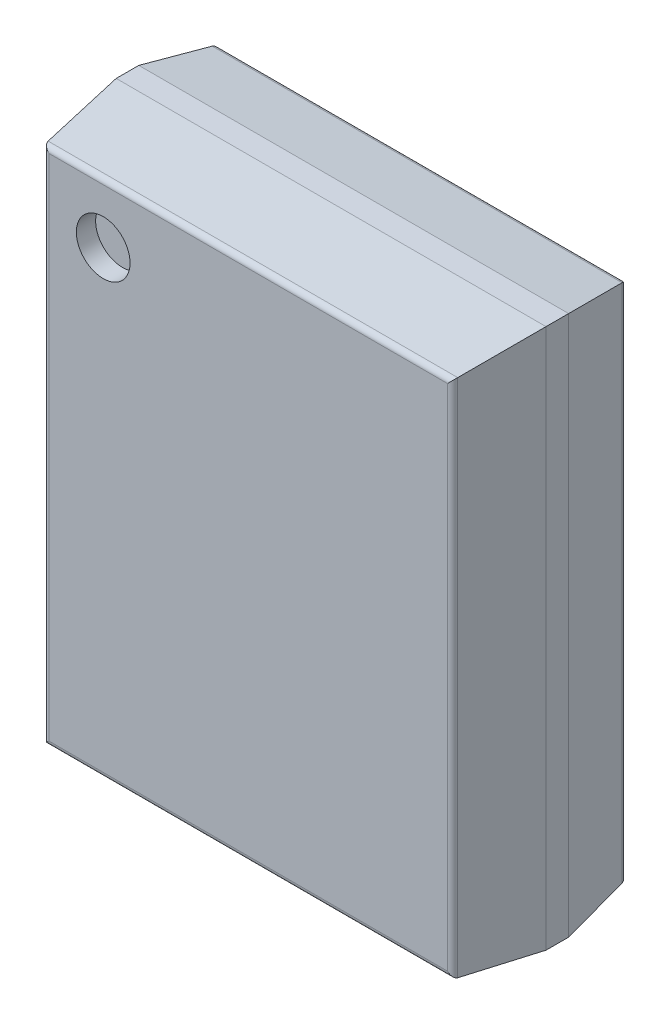
ISO-10303-21;
HEADER;
FILE_DESCRIPTION(('STEP AP214'),'2;1');
FILE_NAME('part.step','',(''),(''),'','','');
FILE_SCHEMA(('AUTOMOTIVE_DESIGN { 1 0 10303 214 1 1 1 1 }'));
ENDSEC;
DATA;
#1=APPLICATION_CONTEXT('core data for automotive mechanical design processes');
#2=APPLICATION_PROTOCOL_DEFINITION('international standard','automotive_design',2000,#1);
#3=PRODUCT_CONTEXT('',#1,'mechanical');
#4=PRODUCT('Part','Part','',(#3));
#5=PRODUCT_RELATED_PRODUCT_CATEGORY('part','',(#4));
#6=PRODUCT_DEFINITION_FORMATION('','',#4);
#7=PRODUCT_DEFINITION_CONTEXT('part definition',#1,'design');
#8=PRODUCT_DEFINITION('design','',#6,#7);
#9=PRODUCT_DEFINITION_SHAPE('','',#8);
#10=(LENGTH_UNIT() NAMED_UNIT(*) SI_UNIT(.MILLI.,.METRE.));
#11=(NAMED_UNIT(*) PLANE_ANGLE_UNIT() SI_UNIT($,.RADIAN.));
#12=(NAMED_UNIT(*) SI_UNIT($,.STERADIAN.) SOLID_ANGLE_UNIT());
#13=UNCERTAINTY_MEASURE_WITH_UNIT(LENGTH_MEASURE(1.E-05),#10,'distance_accuracy_value','');
#14=(GEOMETRIC_REPRESENTATION_CONTEXT(3) GLOBAL_UNCERTAINTY_ASSIGNED_CONTEXT((#13)) GLOBAL_UNIT_ASSIGNED_CONTEXT((#10,
#11,#12)) REPRESENTATION_CONTEXT('',''));
#15=CARTESIAN_POINT('',(0.,0.,0.));
#16=DIRECTION('',(0.,0.,1.));
#17=DIRECTION('',(1.,0.,0.));
#18=AXIS2_PLACEMENT_3D('',#15,#16,#17);
#19=CARTESIAN_POINT('',(-1.315,1.815,1.575));
#20=DIRECTION('',(0.,0.,1.));
#21=DIRECTION('',(1.,0.,0.));
#22=AXIS2_PLACEMENT_3D('',#19,#20,#21);
#23=PLANE('',#22);
#24=CARTESIAN_POINT('',(-1.315,1.815,1.575));
#25=DIRECTION('',(0.,0.,1.));
#26=DIRECTION('',(1.,0.,0.));
#27=AXIS2_PLACEMENT_3D('',#24,#25,#26);
#28=CIRCLE('',#27,0.24375);
#29=CARTESIAN_POINT('',(-1.07125,1.815,1.575));
#30=VERTEX_POINT('',#29);
#31=EDGE_CURVE('E11',#30,#30,#28,.T.);
#32=ORIENTED_EDGE('',*,*,#31,.T.);
#33=EDGE_LOOP('',(#32));
#34=FACE_BOUND('',#33,.T.);
#35=ADVANCED_FACE('F17',(#34),#23,.T.);
#36=CARTESIAN_POINT('',(-1.315,1.815,1.575));
#37=DIRECTION('',(0.,0.,1.));
#38=DIRECTION('',(1.,0.,0.));
#39=AXIS2_PLACEMENT_3D('',#36,#37,#38);
#40=CYLINDRICAL_SURFACE('',#39,0.24375);
#41=CARTESIAN_POINT('',(-1.315,1.815,1.75));
#42=DIRECTION('',(0.,0.,1.));
#43=DIRECTION('',(1.,0.,0.));
#44=AXIS2_PLACEMENT_3D('',#41,#42,#43);
#45=CIRCLE('',#44,0.24375);
#46=CARTESIAN_POINT('',(-1.07125,1.815,1.75));
#47=VERTEX_POINT('',#46);
#48=EDGE_CURVE('E315',#47,#47,#45,.T.);
#49=ORIENTED_EDGE('',*,*,#48,.T.);
#50=EDGE_LOOP('',(#49));
#51=FACE_BOUND('',#50,.T.);
#52=ORIENTED_EDGE('',*,*,#31,.F.);
#53=EDGE_LOOP('',(#52));
#54=FACE_BOUND('',#53,.T.);
#55=ADVANCED_FACE('F580',(#51,#54),#40,.F.);
#56=CARTESIAN_POINT('',(1.808558552786,-2.3525,1.7));
#57=DIRECTION('',(0.,1.,0.));
#58=DIRECTION('',(0.,0.,1.));
#59=AXIS2_PLACEMENT_3D('',#56,#57,#58);
#60=CYLINDRICAL_SURFACE('',#59,0.05);
#61=CARTESIAN_POINT('',(1.808558552786,-2.308558552786,1.7));
#62=DIRECTION('',(-0.707106781186548,-0.707106781186548,0.));
#63=DIRECTION('',(0.707106781186548,-0.707106781186548,0.));
#64=AXIS2_PLACEMENT_3D('',#61,#62,#63);
#65=ELLIPSE('',#64,0.07071067811865,0.05);
#66=CARTESIAN_POINT('',(1.858144342698,-2.358144342698,1.706422572601));
#67=VERTEX_POINT('',#66);
#68=CARTESIAN_POINT('',(1.808558552786,-2.308558552786,1.75));
#69=VERTEX_POINT('',#68);
#70=EDGE_CURVE('E232',#67,#69,#65,.T.);
#71=ORIENTED_EDGE('',*,*,#70,.F.);
#72=DIRECTION('',(0.,1.,0.));
#73=VECTOR('',#72,1.);
#74=CARTESIAN_POINT('',(1.858144342698,-2.3525,1.706422572601));
#75=LINE('',#74,#73);
#76=CARTESIAN_POINT('',(1.858144342698,2.358144342698,1.706422572601));
#77=VERTEX_POINT('',#76);
#78=EDGE_CURVE('E304',#67,#77,#75,.T.);
#79=ORIENTED_EDGE('',*,*,#78,.T.);
#80=CARTESIAN_POINT('',(1.808558552786,2.308558552786,1.7));
#81=DIRECTION('',(-0.707106781186548,0.707106781186548,0.));
#82=DIRECTION('',(0.707106781186548,0.707106781186548,0.));
#83=AXIS2_PLACEMENT_3D('',#80,#81,#82);
#84=ELLIPSE('',#83,0.07071067811865,0.05);
#85=CARTESIAN_POINT('',(1.808558552786,2.308558552786,1.75));
#86=VERTEX_POINT('',#85);
#87=EDGE_CURVE('E25',#86,#77,#84,.T.);
#88=ORIENTED_EDGE('',*,*,#87,.F.);
#89=DIRECTION('',(0.,1.,0.));
#90=VECTOR('',#89,1.);
#91=CARTESIAN_POINT('',(1.808558552786,-2.3525,1.75));
#92=LINE('',#91,#90);
#93=EDGE_CURVE('E43',#69,#86,#92,.T.);
#94=ORIENTED_EDGE('',*,*,#93,.F.);
#95=EDGE_LOOP('',(#71,#79,#88,#94));
#96=FACE_BOUND('',#95,.T.);
#97=ADVANCED_FACE('F325',(#96),#60,.T.);
#98=CARTESIAN_POINT('',(-1.8525,2.308558552786,1.7));
#99=DIRECTION('',(1.,0.,0.));
#100=DIRECTION('',(0.,0.,1.));
#101=AXIS2_PLACEMENT_3D('',#98,#99,#100);
#102=CYLINDRICAL_SURFACE('',#101,0.05);
#103=DIRECTION('',(1.,0.,0.));
#104=VECTOR('',#103,1.);
#105=CARTESIAN_POINT('',(-1.8525,2.308558552786,1.75));
#106=LINE('',#105,#104);
#107=CARTESIAN_POINT('',(-1.808558552786,2.308558552786,1.75));
#108=VERTEX_POINT('',#107);
#109=EDGE_CURVE('E312',#108,#86,#106,.T.);
#110=ORIENTED_EDGE('',*,*,#109,.T.);
#111=ORIENTED_EDGE('',*,*,#87,.T.);
#112=DIRECTION('',(1.,0.,0.));
#113=VECTOR('',#112,1.);
#114=CARTESIAN_POINT('',(-1.8525,2.358144342698,1.706422572601));
#115=LINE('',#114,#113);
#116=CARTESIAN_POINT('',(-1.858144342698,2.358144342698,1.706422572601));
#117=VERTEX_POINT('',#116);
#118=EDGE_CURVE('E212',#117,#77,#115,.T.);
#119=ORIENTED_EDGE('',*,*,#118,.F.);
#120=CARTESIAN_POINT('',(-1.808558552786,2.308558552786,1.7));
#121=DIRECTION('',(0.707106781186548,0.707106781186548,0.));
#122=DIRECTION('',(-0.707106781186548,0.707106781186548,0.));
#123=AXIS2_PLACEMENT_3D('',#120,#121,#122);
#124=ELLIPSE('',#123,0.07071067811865,0.05);
#125=EDGE_CURVE('E203',#117,#108,#124,.T.);
#126=ORIENTED_EDGE('',*,*,#125,.T.);
#127=EDGE_LOOP('',(#110,#111,#119,#126));
#128=FACE_BOUND('',#127,.T.);
#129=ADVANCED_FACE('F322',(#128),#102,.T.);
#130=CARTESIAN_POINT('',(-1.95,-2.45,1.75));
#131=DIRECTION('',(0.,0.,1.));
#132=DIRECTION('',(1.,0.,0.));
#133=AXIS2_PLACEMENT_3D('',#130,#131,#132);
#134=PLANE('',#133);
#135=ORIENTED_EDGE('',*,*,#48,.F.);
#136=EDGE_LOOP('',(#135));
#137=FACE_BOUND('',#136,.T.);
#138=DIRECTION('',(0.,1.,0.));
#139=VECTOR('',#138,1.);
#140=CARTESIAN_POINT('',(-1.808558552786,-2.3525,1.75));
#141=LINE('',#140,#139);
#142=CARTESIAN_POINT('',(-1.808558552786,-2.308558552786,1.75));
#143=VERTEX_POINT('',#142);
#144=EDGE_CURVE('E199',#143,#108,#141,.T.);
#145=ORIENTED_EDGE('',*,*,#144,.F.);
#146=DIRECTION('',(1.,0.,0.));
#147=VECTOR('',#146,1.);
#148=CARTESIAN_POINT('',(-1.8525,-2.308558552786,1.75));
#149=LINE('',#148,#147);
#150=EDGE_CURVE('E229',#143,#69,#149,.T.);
#151=ORIENTED_EDGE('',*,*,#150,.T.);
#152=ORIENTED_EDGE('',*,*,#93,.T.);
#153=ORIENTED_EDGE('',*,*,#109,.F.);
#154=EDGE_LOOP('',(#145,#151,#152,#153));
#155=FACE_BOUND('',#154,.T.);
#156=ADVANCED_FACE('F340',(#137,#155),#134,.T.);
#157=CARTESIAN_POINT('',(-1.8525,-2.308558552786,1.7));
#158=DIRECTION('',(1.,0.,0.));
#159=DIRECTION('',(0.,-0.991715798237691,0.12845145201896));
#160=AXIS2_PLACEMENT_3D('',#157,#158,#159);
#161=CYLINDRICAL_SURFACE('',#160,0.05);
#162=DIRECTION('',(1.,0.,0.));
#163=VECTOR('',#162,1.);
#164=CARTESIAN_POINT('',(-1.8525,-2.358144342698,1.706422572601));
#165=LINE('',#164,#163);
#166=CARTESIAN_POINT('',(-1.858144342698,-2.358144342698,1.706422572601));
#167=VERTEX_POINT('',#166);
#168=EDGE_CURVE('E294',#167,#67,#165,.T.);
#169=ORIENTED_EDGE('',*,*,#168,.T.);
#170=ORIENTED_EDGE('',*,*,#70,.T.);
#171=ORIENTED_EDGE('',*,*,#150,.F.);
#172=CARTESIAN_POINT('',(-1.808558552786,-2.308558552786,1.7));
#173=DIRECTION('',(-0.707106781186548,0.707106781186548,0.));
#174=DIRECTION('',(0.707106781186548,0.707106781186548,0.));
#175=AXIS2_PLACEMENT_3D('',#172,#173,#174);
#176=ELLIPSE('',#175,0.07071067811865,0.05);
#177=EDGE_CURVE('E204',#167,#143,#176,.T.);
#178=ORIENTED_EDGE('',*,*,#177,.F.);
#179=EDGE_LOOP('',(#169,#170,#171,#178));
#180=FACE_BOUND('',#179,.T.);
#181=ADVANCED_FACE('F342',(#180),#161,.T.);
#182=CARTESIAN_POINT('',(1.90125,-2.45,1.373623210137));
#183=DIRECTION('',(0.991715798237691,0.,0.12845145201896));
#184=DIRECTION('',(0.,-1.,0.));
#185=AXIS2_PLACEMENT_3D('',#182,#183,#184);
#186=PLANE('',#185);
#187=DIRECTION('',(-0.12740467794397,0.12740467794397,0.983634127140771));
#188=VECTOR('',#187,1.);
#189=CARTESIAN_POINT('',(1.870389001332,-2.370389001332,1.611887079072));
#190=LINE('',#189,#188);
#191=CARTESIAN_POINT('',(1.95,-2.45,0.997246420274));
#192=VERTEX_POINT('',#191);
#193=EDGE_CURVE('E290',#192,#67,#190,.T.);
#194=ORIENTED_EDGE('',*,*,#193,.F.);
#195=DIRECTION('',(0.,1.,0.));
#196=VECTOR('',#195,1.);
#197=CARTESIAN_POINT('',(1.95,-2.45,0.997246420274));
#198=LINE('',#197,#196);
#199=CARTESIAN_POINT('',(1.95,2.45,0.997246420274));
#200=VERTEX_POINT('',#199);
#201=EDGE_CURVE('E251',#192,#200,#198,.T.);
#202=ORIENTED_EDGE('',*,*,#201,.T.);
#203=DIRECTION('',(-0.12740467794397,-0.12740467794397,0.983634127140771));
#204=VECTOR('',#203,1.);
#205=CARTESIAN_POINT('',(1.830620719025,2.330620719025,1.91892007257));
#206=LINE('',#205,#204);
#207=EDGE_CURVE('E276',#200,#77,#206,.T.);
#208=ORIENTED_EDGE('',*,*,#207,.T.);
#209=ORIENTED_EDGE('',*,*,#78,.F.);
#210=EDGE_LOOP('',(#194,#202,#208,#209));
#211=FACE_BOUND('',#210,.T.);
#212=ADVANCED_FACE('F327',(#211),#186,.T.);
#213=CARTESIAN_POINT('',(-1.95,2.40125,1.373623210137));
#214=DIRECTION('',(0.,0.991715798237691,0.12845145201896));
#215=DIRECTION('',(1.,0.,0.));
#216=AXIS2_PLACEMENT_3D('',#213,#214,#215);
#217=PLANE('',#216);
#218=ORIENTED_EDGE('',*,*,#118,.T.);
#219=ORIENTED_EDGE('',*,*,#207,.F.);
#220=DIRECTION('',(1.,0.,0.));
#221=VECTOR('',#220,1.);
#222=CARTESIAN_POINT('',(-1.95,2.45,0.997246420274));
#223=LINE('',#222,#221);
#224=CARTESIAN_POINT('',(-1.95,2.45,0.997246420274));
#225=VERTEX_POINT('',#224);
#226=EDGE_CURVE('E247',#225,#200,#223,.T.);
#227=ORIENTED_EDGE('',*,*,#226,.F.);
#228=DIRECTION('',(0.12740467794397,-0.12740467794397,0.983634127140771));
#229=VECTOR('',#228,1.);
#230=CARTESIAN_POINT('',(-1.862273025351,2.362273025351,1.674546873663));
#231=LINE('',#230,#229);
#232=EDGE_CURVE('E272',#225,#117,#231,.T.);
#233=ORIENTED_EDGE('',*,*,#232,.T.);
#234=EDGE_LOOP('',(#218,#219,#227,#233));
#235=FACE_BOUND('',#234,.T.);
#236=ADVANCED_FACE('F330',(#235),#217,.T.);
#237=CARTESIAN_POINT('',(-1.808558552786,-2.3525,1.7));
#238=DIRECTION('',(0.,1.,0.));
#239=DIRECTION('',(-0.991715798237691,0.,0.12845145201896));
#240=AXIS2_PLACEMENT_3D('',#237,#238,#239);
#241=CYLINDRICAL_SURFACE('',#240,0.05);
#242=ORIENTED_EDGE('',*,*,#177,.T.);
#243=ORIENTED_EDGE('',*,*,#144,.T.);
#244=ORIENTED_EDGE('',*,*,#125,.F.);
#245=DIRECTION('',(0.,1.,0.));
#246=VECTOR('',#245,1.);
#247=CARTESIAN_POINT('',(-1.858144342698,-2.3525,1.706422572601));
#248=LINE('',#247,#246);
#249=EDGE_CURVE('E268',#167,#117,#248,.T.);
#250=ORIENTED_EDGE('',*,*,#249,.F.);
#251=EDGE_LOOP('',(#242,#243,#244,#250));
#252=FACE_BOUND('',#251,.T.);
#253=ADVANCED_FACE('F337',(#252),#241,.T.);
#254=CARTESIAN_POINT('',(-1.95,-2.40125,1.373623210137));
#255=DIRECTION('',(0.,0.991715798237691,-0.12845145201896));
#256=DIRECTION('',(-1.,0.,0.));
#257=AXIS2_PLACEMENT_3D('',#254,#255,#256);
#258=PLANE('',#257);
#259=DIRECTION('',(0.12740467794397,0.12740467794397,0.983634127140771));
#260=VECTOR('',#259,1.);
#261=CARTESIAN_POINT('',(-1.902041307658,-2.402041307658,1.367513880164));
#262=LINE('',#261,#260);
#263=CARTESIAN_POINT('',(-1.95,-2.45,0.997246420274));
#264=VERTEX_POINT('',#263);
#265=EDGE_CURVE('E280',#264,#167,#262,.T.);
#266=ORIENTED_EDGE('',*,*,#265,.F.);
#267=DIRECTION('',(1.,0.,0.));
#268=VECTOR('',#267,1.);
#269=CARTESIAN_POINT('',(-1.95,-2.45,0.997246420274));
#270=LINE('',#269,#268);
#271=EDGE_CURVE('E238',#264,#192,#270,.T.);
#272=ORIENTED_EDGE('',*,*,#271,.T.);
#273=ORIENTED_EDGE('',*,*,#193,.T.);
#274=ORIENTED_EDGE('',*,*,#168,.F.);
#275=EDGE_LOOP('',(#266,#272,#273,#274));
#276=FACE_BOUND('',#275,.T.);
#277=ADVANCED_FACE('F345',(#276),#258,.F.);
#278=CARTESIAN_POINT('',(1.95,-2.45,0.175));
#279=DIRECTION('',(1.,0.,0.));
#280=DIRECTION('',(0.,1.,0.));
#281=AXIS2_PLACEMENT_3D('',#278,#279,#280);
#282=PLANE('',#281);
#283=DIRECTION('',(0.,0.,1.));
#284=VECTOR('',#283,1.);
#285=CARTESIAN_POINT('',(1.95,-2.45,0.175));
#286=LINE('',#285,#284);
#287=CARTESIAN_POINT('',(1.95,-2.45,0.792246420274));
#288=VERTEX_POINT('',#287);
#289=EDGE_CURVE('E242',#288,#192,#286,.T.);
#290=ORIENTED_EDGE('',*,*,#289,.F.);
#291=DIRECTION('',(0.,1.,0.));
#292=VECTOR('',#291,1.);
#293=CARTESIAN_POINT('',(1.95,-2.45,0.792246420274));
#294=LINE('',#293,#292);
#295=CARTESIAN_POINT('',(1.95,2.45,0.792246420274));
#296=VERTEX_POINT('',#295);
#297=EDGE_CURVE('E256',#288,#296,#294,.T.);
#298=ORIENTED_EDGE('',*,*,#297,.T.);
#299=DIRECTION('',(0.,0.,1.));
#300=VECTOR('',#299,1.);
#301=CARTESIAN_POINT('',(1.95,2.45,0.175));
#302=LINE('',#301,#300);
#303=EDGE_CURVE('E252',#296,#200,#302,.T.);
#304=ORIENTED_EDGE('',*,*,#303,.T.);
#305=ORIENTED_EDGE('',*,*,#201,.F.);
#306=EDGE_LOOP('',(#290,#298,#304,#305));
#307=FACE_BOUND('',#306,.T.);
#308=ADVANCED_FACE('F349',(#307),#282,.T.);
#309=CARTESIAN_POINT('',(1.809778042507,-2.3525,0.225));
#310=DIRECTION('',(0.,1.,0.));
#311=DIRECTION('',(0.,0.,-1.));
#312=AXIS2_PLACEMENT_3D('',#309,#310,#311);
#313=CYLINDRICAL_SURFACE('',#312,0.05);
#314=DIRECTION('',(0.,1.,0.));
#315=VECTOR('',#314,1.);
#316=CARTESIAN_POINT('',(1.809778042507,-2.3525,0.175));
#317=LINE('',#316,#315);
#318=CARTESIAN_POINT('',(1.809778042507,-2.309778042507,0.175));
#319=VERTEX_POINT('',#318);
#320=CARTESIAN_POINT('',(1.809778042507,2.309778042507,0.175));
#321=VERTEX_POINT('',#320);
#322=EDGE_CURVE('E264',#319,#321,#317,.T.);
#323=ORIENTED_EDGE('',*,*,#322,.T.);
#324=CARTESIAN_POINT('',(1.809778042507,2.309778042507,0.225));
#325=DIRECTION('',(0.707106781186548,-0.707106781186548,0.));
#326=DIRECTION('',(0.707106781186548,0.707106781186548,0.));
#327=AXIS2_PLACEMENT_3D('',#324,#325,#326);
#328=ELLIPSE('',#327,0.07071067811865,0.05);
#329=CARTESIAN_POINT('',(1.859165697143,2.359165697143,0.217198745641));
#330=VERTEX_POINT('',#329);
#331=EDGE_CURVE('E185',#321,#330,#328,.T.);
#332=ORIENTED_EDGE('',*,*,#331,.T.);
#333=DIRECTION('',(0.,1.,0.));
#334=VECTOR('',#333,1.);
#335=CARTESIAN_POINT('',(1.859165697143,-2.3525,0.217198745641));
#336=LINE('',#335,#334);
#337=CARTESIAN_POINT('',(1.859165697143,-2.359165697143,0.217198745641));
#338=VERTEX_POINT('',#337);
#339=EDGE_CURVE('E246',#338,#330,#336,.T.);
#340=ORIENTED_EDGE('',*,*,#339,.F.);
#341=CARTESIAN_POINT('',(1.809778042507,-2.309778042507,0.225));
#342=DIRECTION('',(0.707106781186548,0.707106781186548,0.));
#343=DIRECTION('',(0.707106781186548,-0.707106781186548,0.));
#344=AXIS2_PLACEMENT_3D('',#341,#342,#343);
#345=ELLIPSE('',#344,0.07071067811865,0.05);
#346=EDGE_CURVE('E154',#338,#319,#345,.T.);
#347=ORIENTED_EDGE('',*,*,#346,.T.);
#348=EDGE_LOOP('',(#323,#332,#340,#347));
#349=FACE_BOUND('',#348,.T.);
#350=ADVANCED_FACE('F535',(#349),#313,.T.);
#351=CARTESIAN_POINT('',(-1.95,2.45,0.175));
#352=DIRECTION('',(0.,1.,0.));
#353=DIRECTION('',(1.,0.,0.));
#354=AXIS2_PLACEMENT_3D('',#351,#352,#353);
#355=PLANE('',#354);
#356=ORIENTED_EDGE('',*,*,#303,.F.);
#357=DIRECTION('',(1.,0.,0.));
#358=VECTOR('',#357,1.);
#359=CARTESIAN_POINT('',(-1.95,2.45,0.792246420274));
#360=LINE('',#359,#358);
#361=CARTESIAN_POINT('',(-1.95,2.45,0.792246420274));
#362=VERTEX_POINT('',#361);
#363=EDGE_CURVE('E228',#362,#296,#360,.T.);
#364=ORIENTED_EDGE('',*,*,#363,.F.);
#365=DIRECTION('',(0.,0.,1.));
#366=VECTOR('',#365,1.);
#367=CARTESIAN_POINT('',(-1.95,2.45,0.175));
#368=LINE('',#367,#366);
#369=EDGE_CURVE('E220',#362,#225,#368,.T.);
#370=ORIENTED_EDGE('',*,*,#369,.T.);
#371=ORIENTED_EDGE('',*,*,#226,.T.);
#372=EDGE_LOOP('',(#356,#364,#370,#371));
#373=FACE_BOUND('',#372,.T.);
#374=ADVANCED_FACE('F621',(#373),#355,.T.);
#375=CARTESIAN_POINT('',(-1.90125,-2.45,1.373623210137));
#376=DIRECTION('',(0.991715798237691,0.,-0.12845145201896));
#377=DIRECTION('',(0.,-1.,0.));
#378=AXIS2_PLACEMENT_3D('',#375,#376,#377);
#379=PLANE('',#378);
#380=ORIENTED_EDGE('',*,*,#249,.T.);
#381=ORIENTED_EDGE('',*,*,#232,.F.);
#382=DIRECTION('',(0.,1.,0.));
#383=VECTOR('',#382,1.);
#384=CARTESIAN_POINT('',(-1.95,-2.45,0.997246420274));
#385=LINE('',#384,#383);
#386=EDGE_CURVE('E147',#264,#225,#385,.T.);
#387=ORIENTED_EDGE('',*,*,#386,.F.);
#388=ORIENTED_EDGE('',*,*,#265,.T.);
#389=EDGE_LOOP('',(#380,#381,#387,#388));
#390=FACE_BOUND('',#389,.T.);
#391=ADVANCED_FACE('F335',(#390),#379,.F.);
#392=CARTESIAN_POINT('',(-1.8525,2.309778042507,0.225));
#393=DIRECTION('',(1.,0.,0.));
#394=DIRECTION('',(0.,0.,-1.));
#395=AXIS2_PLACEMENT_3D('',#392,#393,#394);
#396=CYLINDRICAL_SURFACE('',#395,0.05);
#397=CARTESIAN_POINT('',(-1.809778042507,2.309778042507,0.225));
#398=DIRECTION('',(-0.707106781186548,-0.707106781186548,0.));
#399=DIRECTION('',(-0.707106781186548,0.707106781186548,0.));
#400=AXIS2_PLACEMENT_3D('',#397,#398,#399);
#401=ELLIPSE('',#400,0.07071067811865,0.05);
#402=CARTESIAN_POINT('',(-1.859165697143,2.359165697143,0.217198745641));
#403=VERTEX_POINT('',#402);
#404=CARTESIAN_POINT('',(-1.809778042507,2.309778042507,0.175));
#405=VERTEX_POINT('',#404);
#406=EDGE_CURVE('E190',#403,#405,#401,.T.);
#407=ORIENTED_EDGE('',*,*,#406,.F.);
#408=DIRECTION('',(1.,0.,0.));
#409=VECTOR('',#408,1.);
#410=CARTESIAN_POINT('',(-1.8525,2.359165697143,0.217198745641));
#411=LINE('',#410,#409);
#412=EDGE_CURVE('E193',#403,#330,#411,.T.);
#413=ORIENTED_EDGE('',*,*,#412,.T.);
#414=ORIENTED_EDGE('',*,*,#331,.F.);
#415=DIRECTION('',(1.,0.,0.));
#416=VECTOR('',#415,1.);
#417=CARTESIAN_POINT('',(-1.8525,2.309778042507,0.175));
#418=LINE('',#417,#416);
#419=EDGE_CURVE('E260',#405,#321,#418,.T.);
#420=ORIENTED_EDGE('',*,*,#419,.F.);
#421=EDGE_LOOP('',(#407,#413,#414,#420));
#422=FACE_BOUND('',#421,.T.);
#423=ADVANCED_FACE('F597',(#422),#396,.T.);
#424=CARTESIAN_POINT('',(-1.95,-2.45,0.175));
#425=DIRECTION('',(0.,0.,1.));
#426=DIRECTION('',(1.,0.,0.));
#427=AXIS2_PLACEMENT_3D('',#424,#425,#426);
#428=PLANE('',#427);
#429=ORIENTED_EDGE('',*,*,#419,.T.);
#430=ORIENTED_EDGE('',*,*,#322,.F.);
#431=DIRECTION('',(1.,0.,0.));
#432=VECTOR('',#431,1.);
#433=CARTESIAN_POINT('',(-1.8525,-2.309778042507,0.175));
#434=LINE('',#433,#432);
#435=CARTESIAN_POINT('',(-1.809778042507,-2.309778042507,0.175));
#436=VERTEX_POINT('',#435);
#437=EDGE_CURVE('E197',#436,#319,#434,.T.);
#438=ORIENTED_EDGE('',*,*,#437,.F.);
#439=DIRECTION('',(0.,1.,0.));
#440=VECTOR('',#439,1.);
#441=CARTESIAN_POINT('',(-1.809778042507,-2.3525,0.175));
#442=LINE('',#441,#440);
#443=EDGE_CURVE('E143',#436,#405,#442,.T.);
#444=ORIENTED_EDGE('',*,*,#443,.T.);
#445=EDGE_LOOP('',(#429,#430,#438,#444));
#446=FACE_BOUND('',#445,.T.);
#447=ADVANCED_FACE('F589',(#446),#428,.F.);
#448=CARTESIAN_POINT('',(1.90125,-2.45,0.483623210137));
#449=DIRECTION('',(-0.987753092714965,0.,0.156025087187994));
#450=DIRECTION('',(0.,1.,0.));
#451=AXIS2_PLACEMENT_3D('',#448,#449,#450);
#452=PLANE('',#451);
#453=ORIENTED_EDGE('',*,*,#339,.T.);
#454=DIRECTION('',(-0.154159948465985,-0.154159948465985,-0.975945398358909));
#455=VECTOR('',#454,1.);
#456=CARTESIAN_POINT('',(1.797841283145,2.297841283145,-0.171029716054));
#457=LINE('',#456,#455);
#458=EDGE_CURVE('E198',#296,#330,#457,.T.);
#459=ORIENTED_EDGE('',*,*,#458,.F.);
#460=ORIENTED_EDGE('',*,*,#297,.F.);
#461=DIRECTION('',(-0.154159948465985,0.154159948465985,-0.975945398358909));
#462=VECTOR('',#461,1.);
#463=CARTESIAN_POINT('',(1.856066242937,-2.356066242937,0.197576930121));
#464=LINE('',#463,#462);
#465=EDGE_CURVE('E160',#288,#338,#464,.T.);
#466=ORIENTED_EDGE('',*,*,#465,.T.);
#467=EDGE_LOOP('',(#453,#459,#460,#466));
#468=FACE_BOUND('',#467,.T.);
#469=ADVANCED_FACE('F353',(#468),#452,.F.);
#470=CARTESIAN_POINT('',(-1.95,-2.45,0.175));
#471=DIRECTION('',(0.,1.,0.));
#472=DIRECTION('',(1.,0.,0.));
#473=AXIS2_PLACEMENT_3D('',#470,#471,#472);
#474=PLANE('',#473);
#475=ORIENTED_EDGE('',*,*,#271,.F.);
#476=DIRECTION('',(0.,0.,1.));
#477=VECTOR('',#476,1.);
#478=CARTESIAN_POINT('',(-1.95,-2.45,0.175));
#479=LINE('',#478,#477);
#480=CARTESIAN_POINT('',(-1.95,-2.45,0.792246420274));
#481=VERTEX_POINT('',#480);
#482=EDGE_CURVE('E224',#481,#264,#479,.T.);
#483=ORIENTED_EDGE('',*,*,#482,.F.);
#484=DIRECTION('',(1.,0.,0.));
#485=VECTOR('',#484,1.);
#486=CARTESIAN_POINT('',(-1.95,-2.45,0.792246420274));
#487=LINE('',#486,#485);
#488=EDGE_CURVE('E174',#481,#288,#487,.T.);
#489=ORIENTED_EDGE('',*,*,#488,.T.);
#490=ORIENTED_EDGE('',*,*,#289,.T.);
#491=EDGE_LOOP('',(#475,#483,#489,#490));
#492=FACE_BOUND('',#491,.T.);
#493=ADVANCED_FACE('F351',(#492),#474,.F.);
#494=CARTESIAN_POINT('',(-1.8525,-2.309778042507,0.225));
#495=DIRECTION('',(1.,0.,0.));
#496=DIRECTION('',(0.,-0.987753092714965,-0.156025087187994));
#497=AXIS2_PLACEMENT_3D('',#494,#495,#496);
#498=CYLINDRICAL_SURFACE('',#497,0.05);
#499=CARTESIAN_POINT('',(-1.809778042507,-2.309778042507,0.225));
#500=DIRECTION('',(0.707106781186548,-0.707106781186548,0.));
#501=DIRECTION('',(0.707106781186548,0.707106781186548,0.));
#502=AXIS2_PLACEMENT_3D('',#499,#500,#501);
#503=ELLIPSE('',#502,0.07071067811865,0.05);
#504=CARTESIAN_POINT('',(-1.859165697143,-2.359165697143,0.217198745641));
#505=VERTEX_POINT('',#504);
#506=EDGE_CURVE('E135',#505,#436,#503,.T.);
#507=ORIENTED_EDGE('',*,*,#506,.T.);
#508=ORIENTED_EDGE('',*,*,#437,.T.);
#509=ORIENTED_EDGE('',*,*,#346,.F.);
#510=DIRECTION('',(1.,0.,0.));
#511=VECTOR('',#510,1.);
#512=CARTESIAN_POINT('',(-1.8525,-2.359165697143,0.217198745641));
#513=LINE('',#512,#511);
#514=EDGE_CURVE('E151',#505,#338,#513,.T.);
#515=ORIENTED_EDGE('',*,*,#514,.F.);
#516=EDGE_LOOP('',(#507,#508,#509,#515));
#517=FACE_BOUND('',#516,.T.);
#518=ADVANCED_FACE('F152',(#517),#498,.T.);
#519=CARTESIAN_POINT('',(-1.95,2.40125,0.483623210137));
#520=DIRECTION('',(0.,-0.987753092714965,0.156025087187994));
#521=DIRECTION('',(-1.,0.,0.));
#522=AXIS2_PLACEMENT_3D('',#519,#520,#521);
#523=PLANE('',#522);
#524=DIRECTION('',(0.154159948465985,-0.154159948465985,-0.975945398358909));
#525=VECTOR('',#524,1.);
#526=CARTESIAN_POINT('',(-1.844183598082,2.344183598082,0.122351083963));
#527=LINE('',#526,#525);
#528=EDGE_CURVE('E168',#362,#403,#527,.T.);
#529=ORIENTED_EDGE('',*,*,#528,.F.);
#530=ORIENTED_EDGE('',*,*,#363,.T.);
#531=ORIENTED_EDGE('',*,*,#458,.T.);
#532=ORIENTED_EDGE('',*,*,#412,.F.);
#533=EDGE_LOOP('',(#529,#530,#531,#532));
#534=FACE_BOUND('',#533,.T.);
#535=ADVANCED_FACE('F357',(#534),#523,.F.);
#536=CARTESIAN_POINT('',(-1.95,-2.45,0.175));
#537=DIRECTION('',(1.,0.,0.));
#538=DIRECTION('',(0.,1.,0.));
#539=AXIS2_PLACEMENT_3D('',#536,#537,#538);
#540=PLANE('',#539);
#541=ORIENTED_EDGE('',*,*,#386,.T.);
#542=ORIENTED_EDGE('',*,*,#369,.F.);
#543=DIRECTION('',(0.,1.,0.));
#544=VECTOR('',#543,1.);
#545=CARTESIAN_POINT('',(-1.95,-2.45,0.792246420274));
#546=LINE('',#545,#544);
#547=EDGE_CURVE('E177',#481,#362,#546,.T.);
#548=ORIENTED_EDGE('',*,*,#547,.F.);
#549=ORIENTED_EDGE('',*,*,#482,.T.);
#550=EDGE_LOOP('',(#541,#542,#548,#549));
#551=FACE_BOUND('',#550,.T.);
#552=ADVANCED_FACE('F544',(#551),#540,.F.);
#553=CARTESIAN_POINT('',(-1.809778042507,-2.3525,0.225));
#554=DIRECTION('',(0.,1.,0.));
#555=DIRECTION('',(-0.987753092714965,0.,-0.156025087187994));
#556=AXIS2_PLACEMENT_3D('',#553,#554,#555);
#557=CYLINDRICAL_SURFACE('',#556,0.05);
#558=DIRECTION('',(0.,1.,0.));
#559=VECTOR('',#558,1.);
#560=CARTESIAN_POINT('',(-1.859165697143,-2.3525,0.217198745641));
#561=LINE('',#560,#559);
#562=EDGE_CURVE('E140',#505,#403,#561,.T.);
#563=ORIENTED_EDGE('',*,*,#562,.T.);
#564=ORIENTED_EDGE('',*,*,#406,.T.);
#565=ORIENTED_EDGE('',*,*,#443,.F.);
#566=ORIENTED_EDGE('',*,*,#506,.F.);
#567=EDGE_LOOP('',(#563,#564,#565,#566));
#568=FACE_BOUND('',#567,.T.);
#569=ADVANCED_FACE('F137',(#568),#557,.T.);
#570=CARTESIAN_POINT('',(-1.95,-2.40125,0.483623210137));
#571=DIRECTION('',(0.,-0.987753092714965,-0.156025087187994));
#572=DIRECTION('',(0.,0.156025087187994,-0.987753092714965));
#573=AXIS2_PLACEMENT_3D('',#570,#571,#572);
#574=PLANE('',#573);
#575=ORIENTED_EDGE('',*,*,#514,.T.);
#576=ORIENTED_EDGE('',*,*,#465,.F.);
#577=ORIENTED_EDGE('',*,*,#488,.F.);
#578=DIRECTION('',(0.154159948465985,0.154159948465985,-0.975945398358909));
#579=VECTOR('',#578,1.);
#580=CARTESIAN_POINT('',(-1.902408557873,-2.402408557873,0.490957730138));
#581=LINE('',#580,#579);
#582=EDGE_CURVE('E166',#481,#505,#581,.T.);
#583=ORIENTED_EDGE('',*,*,#582,.T.);
#584=EDGE_LOOP('',(#575,#576,#577,#583));
#585=FACE_BOUND('',#584,.T.);
#586=ADVANCED_FACE('F172',(#585),#574,.T.);
#587=CARTESIAN_POINT('',(-1.90125,-2.45,0.483623210137));
#588=DIRECTION('',(-0.987753092714965,0.,-0.156025087187994));
#589=DIRECTION('',(-0.156025087187994,0.,0.987753092714965));
#590=AXIS2_PLACEMENT_3D('',#587,#588,#589);
#591=PLANE('',#590);
#592=ORIENTED_EDGE('',*,*,#582,.F.);
#593=ORIENTED_EDGE('',*,*,#547,.T.);
#594=ORIENTED_EDGE('',*,*,#528,.T.);
#595=ORIENTED_EDGE('',*,*,#562,.F.);
#596=EDGE_LOOP('',(#592,#593,#594,#595));
#597=FACE_BOUND('',#596,.T.);
#598=ADVANCED_FACE('F164',(#597),#591,.T.);
#599=CLOSED_SHELL('',(#35,#55,#97,#129,#156,#181,#212,#236,#253,#277,#308,#350,#374,#391,#423,
#447,#469,#493,#518,#535,#552,#569,#586,#598));
#600=MANIFOLD_SOLID_BREP('B1',#599);
#601=ADVANCED_BREP_SHAPE_REPRESENTATION('',(#18,#600),#14);
#602=SHAPE_DEFINITION_REPRESENTATION(#9,#601);
ENDSEC;
END-ISO-10303-21;
